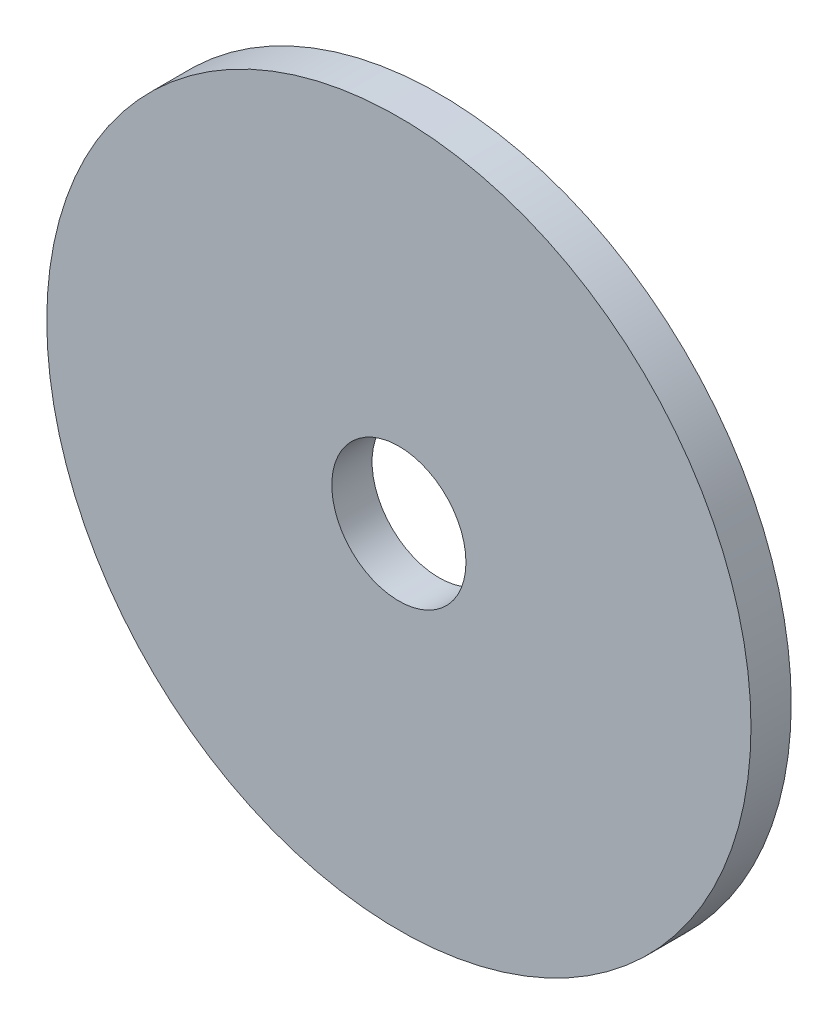
ISO-10303-21;
HEADER;
FILE_DESCRIPTION(('STEP AP214'),'2;1');
FILE_NAME('part.step','',(''),(''),'','','');
FILE_SCHEMA(('AUTOMOTIVE_DESIGN { 1 0 10303 214 1 1 1 1 }'));
ENDSEC;
DATA;
#1=APPLICATION_CONTEXT('core data for automotive mechanical design processes');
#2=APPLICATION_PROTOCOL_DEFINITION('international standard','automotive_design',2000,#1);
#3=PRODUCT_CONTEXT('',#1,'mechanical');
#4=PRODUCT('Part','Part','',(#3));
#5=PRODUCT_RELATED_PRODUCT_CATEGORY('part','',(#4));
#6=PRODUCT_DEFINITION_FORMATION('','',#4);
#7=PRODUCT_DEFINITION_CONTEXT('part definition',#1,'design');
#8=PRODUCT_DEFINITION('design','',#6,#7);
#9=PRODUCT_DEFINITION_SHAPE('','',#8);
#10=(LENGTH_UNIT() NAMED_UNIT(*) SI_UNIT(.MILLI.,.METRE.));
#11=(NAMED_UNIT(*) PLANE_ANGLE_UNIT() SI_UNIT($,.RADIAN.));
#12=(NAMED_UNIT(*) SI_UNIT($,.STERADIAN.) SOLID_ANGLE_UNIT());
#13=UNCERTAINTY_MEASURE_WITH_UNIT(LENGTH_MEASURE(1.E-05),#10,'distance_accuracy_value','');
#14=(GEOMETRIC_REPRESENTATION_CONTEXT(3) GLOBAL_UNCERTAINTY_ASSIGNED_CONTEXT((#13)) GLOBAL_UNIT_ASSIGNED_CONTEXT((#10,
#11,#12)) REPRESENTATION_CONTEXT('',''));
#15=CARTESIAN_POINT('',(0.,0.,0.));
#16=DIRECTION('',(0.,0.,1.));
#17=DIRECTION('',(1.,0.,0.));
#18=AXIS2_PLACEMENT_3D('',#15,#16,#17);
#19=CARTESIAN_POINT('',(0.,0.,6.));
#20=DIRECTION('',(0.,0.,1.));
#21=DIRECTION('',(1.,0.,0.));
#22=AXIS2_PLACEMENT_3D('',#19,#20,#21);
#23=PLANE('',#22);
#24=CARTESIAN_POINT('',(0.,0.,6.));
#25=DIRECTION('',(0.,0.,1.));
#26=DIRECTION('',(1.,0.,0.));
#27=AXIS2_PLACEMENT_3D('',#24,#25,#26);
#28=CIRCLE('',#27,52.5);
#29=CARTESIAN_POINT('',(52.5,0.,6.));
#30=VERTEX_POINT('',#29);
#31=EDGE_CURVE('E10',#30,#30,#28,.T.);
#32=ORIENTED_EDGE('',*,*,#31,.T.);
#33=EDGE_LOOP('',(#32));
#34=FACE_BOUND('',#33,.T.);
#35=CARTESIAN_POINT('',(0.,0.,6.));
#36=DIRECTION('',(0.,0.,1.));
#37=DIRECTION('',(1.,0.,0.));
#38=AXIS2_PLACEMENT_3D('',#35,#36,#37);
#39=CIRCLE('',#38,10.);
#40=CARTESIAN_POINT('',(10.,0.,6.));
#41=VERTEX_POINT('',#40);
#42=EDGE_CURVE('E42',#41,#41,#39,.T.);
#43=ORIENTED_EDGE('',*,*,#42,.F.);
#44=EDGE_LOOP('',(#43));
#45=FACE_BOUND('',#44,.T.);
#46=ADVANCED_FACE('F31',(#34,#45),#23,.T.);
#47=CARTESIAN_POINT('',(0.,0.,0.));
#48=DIRECTION('',(0.,0.,1.));
#49=DIRECTION('',(1.,0.,0.));
#50=AXIS2_PLACEMENT_3D('',#47,#48,#49);
#51=PLANE('',#50);
#52=CARTESIAN_POINT('',(0.,0.,0.));
#53=DIRECTION('',(0.,0.,1.));
#54=DIRECTION('',(1.,0.,0.));
#55=AXIS2_PLACEMENT_3D('',#52,#53,#54);
#56=CIRCLE('',#55,52.5);
#57=CARTESIAN_POINT('',(52.5,0.,0.));
#58=VERTEX_POINT('',#57);
#59=EDGE_CURVE('E35',#58,#58,#56,.T.);
#60=ORIENTED_EDGE('',*,*,#59,.F.);
#61=EDGE_LOOP('',(#60));
#62=FACE_BOUND('',#61,.T.);
#63=CARTESIAN_POINT('',(0.,0.,0.));
#64=DIRECTION('',(0.,0.,1.));
#65=DIRECTION('',(1.,0.,0.));
#66=AXIS2_PLACEMENT_3D('',#63,#64,#65);
#67=CIRCLE('',#66,10.);
#68=CARTESIAN_POINT('',(10.,0.,0.));
#69=VERTEX_POINT('',#68);
#70=EDGE_CURVE('E44',#69,#69,#67,.T.);
#71=ORIENTED_EDGE('',*,*,#70,.T.);
#72=EDGE_LOOP('',(#71));
#73=FACE_BOUND('',#72,.T.);
#74=ADVANCED_FACE('F54',(#62,#73),#51,.F.);
#75=CARTESIAN_POINT('',(0.,0.,6.));
#76=DIRECTION('',(0.,0.,-1.));
#77=DIRECTION('',(-1.,0.,0.));
#78=AXIS2_PLACEMENT_3D('',#75,#76,#77);
#79=CYLINDRICAL_SURFACE('',#78,52.5);
#80=ORIENTED_EDGE('',*,*,#31,.F.);
#81=EDGE_LOOP('',(#80));
#82=FACE_BOUND('',#81,.T.);
#83=ORIENTED_EDGE('',*,*,#59,.T.);
#84=EDGE_LOOP('',(#83));
#85=FACE_BOUND('',#84,.T.);
#86=ADVANCED_FACE('F33',(#82,#85),#79,.T.);
#87=CARTESIAN_POINT('',(0.,0.,6.));
#88=DIRECTION('',(0.,0.,-1.));
#89=DIRECTION('',(-1.,0.,0.));
#90=AXIS2_PLACEMENT_3D('',#87,#88,#89);
#91=CYLINDRICAL_SURFACE('',#90,10.);
#92=ORIENTED_EDGE('',*,*,#42,.T.);
#93=EDGE_LOOP('',(#92));
#94=FACE_BOUND('',#93,.T.);
#95=ORIENTED_EDGE('',*,*,#70,.F.);
#96=EDGE_LOOP('',(#95));
#97=FACE_BOUND('',#96,.T.);
#98=ADVANCED_FACE('F50',(#94,#97),#91,.F.);
#99=CLOSED_SHELL('',(#46,#74,#86,#98));
#100=MANIFOLD_SOLID_BREP('B2',#99);
#101=ADVANCED_BREP_SHAPE_REPRESENTATION('',(#18,#100),#14);
#102=SHAPE_DEFINITION_REPRESENTATION(#9,#101);
ENDSEC;
END-ISO-10303-21;
